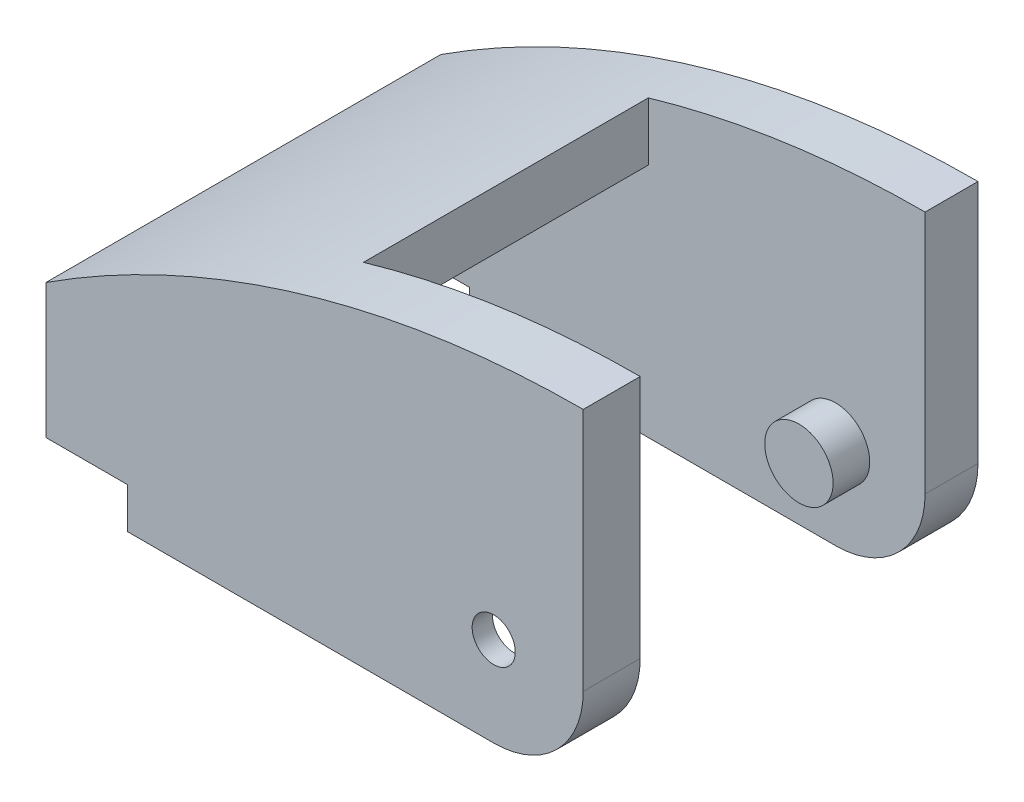
ISO-10303-21;
HEADER;
FILE_DESCRIPTION(('STEP AP214'),'2;1');
FILE_NAME('part.step','',(''),(''),'','','');
FILE_SCHEMA(('AUTOMOTIVE_DESIGN { 1 0 10303 214 1 1 1 1 }'));
ENDSEC;
DATA;
#1=APPLICATION_CONTEXT('core data for automotive mechanical design processes');
#2=APPLICATION_PROTOCOL_DEFINITION('international standard','automotive_design',2000,#1);
#3=PRODUCT_CONTEXT('',#1,'mechanical');
#4=PRODUCT('Part','Part','',(#3));
#5=PRODUCT_RELATED_PRODUCT_CATEGORY('part','',(#4));
#6=PRODUCT_DEFINITION_FORMATION('','',#4);
#7=PRODUCT_DEFINITION_CONTEXT('part definition',#1,'design');
#8=PRODUCT_DEFINITION('design','',#6,#7);
#9=PRODUCT_DEFINITION_SHAPE('','',#8);
#10=(LENGTH_UNIT() NAMED_UNIT(*) SI_UNIT(.MILLI.,.METRE.));
#11=(NAMED_UNIT(*) PLANE_ANGLE_UNIT() SI_UNIT($,.RADIAN.));
#12=(NAMED_UNIT(*) SI_UNIT($,.STERADIAN.) SOLID_ANGLE_UNIT());
#13=UNCERTAINTY_MEASURE_WITH_UNIT(LENGTH_MEASURE(1.E-05),#10,'distance_accuracy_value','');
#14=(GEOMETRIC_REPRESENTATION_CONTEXT(3) GLOBAL_UNCERTAINTY_ASSIGNED_CONTEXT((#13)) GLOBAL_UNIT_ASSIGNED_CONTEXT((#10,
#11,#12)) REPRESENTATION_CONTEXT('',''));
#15=CARTESIAN_POINT('',(0.,0.,0.));
#16=DIRECTION('',(0.,0.,1.));
#17=DIRECTION('',(1.,0.,0.));
#18=AXIS2_PLACEMENT_3D('',#15,#16,#17);
#19=CARTESIAN_POINT('',(12.,-12.,-7.));
#20=DIRECTION('',(0.,0.,1.));
#21=DIRECTION('',(0.,-1.,0.));
#22=AXIS2_PLACEMENT_3D('',#19,#20,#21);
#23=PLANE('',#22);
#24=CARTESIAN_POINT('',(0.,0.,-7.));
#25=DIRECTION('',(0.,0.,-1.));
#26=DIRECTION('',(0.,1.,0.));
#27=AXIS2_PLACEMENT_3D('',#24,#25,#26);
#28=CIRCLE('',#27,9.5);
#29=CARTESIAN_POINT('',(0.,9.5,-7.));
#30=VERTEX_POINT('',#29);
#31=EDGE_CURVE('E342',#30,#30,#28,.T.);
#32=ORIENTED_EDGE('',*,*,#31,.F.);
#33=EDGE_LOOP('',(#32));
#34=FACE_BOUND('',#33,.T.);
#35=DIRECTION('',(-1.,0.,0.));
#36=VECTOR('',#35,1.);
#37=CARTESIAN_POINT('',(0.,-11.,-7.));
#38=LINE('',#37,#36);
#39=CARTESIAN_POINT('',(0.,-11.,-7.));
#40=VERTEX_POINT('',#39);
#41=CARTESIAN_POINT('',(-45.,-11.,-6.99999999999999));
#42=VERTEX_POINT('',#41);
#43=EDGE_CURVE('E283',#40,#42,#38,.T.);
#44=ORIENTED_EDGE('',*,*,#43,.T.);
#45=DIRECTION('',(0.,1.,0.));
#46=VECTOR('',#45,1.);
#47=CARTESIAN_POINT('',(-45.,-12.,-7.));
#48=LINE('',#47,#46);
#49=CARTESIAN_POINT('',(-45.,-6.00000000000001,-7.));
#50=VERTEX_POINT('',#49);
#51=EDGE_CURVE('E209',#42,#50,#48,.T.);
#52=ORIENTED_EDGE('',*,*,#51,.T.);
#53=DIRECTION('',(-1.,0.,0.));
#54=VECTOR('',#53,1.);
#55=CARTESIAN_POINT('',(12.,-6.00000000000001,-7.));
#56=LINE('',#55,#54);
#57=CARTESIAN_POINT('',(-55.,-6.,-6.99999999999999));
#58=VERTEX_POINT('',#57);
#59=EDGE_CURVE('E169',#50,#58,#56,.T.);
#60=ORIENTED_EDGE('',*,*,#59,.T.);
#61=DIRECTION('',(0.,-1.,0.));
#62=VECTOR('',#61,1.);
#63=CARTESIAN_POINT('',(-55.,-12.,-7.));
#64=LINE('',#63,#62);
#65=CARTESIAN_POINT('',(-54.9999999999999,6.91625959501332,-6.99999999999999));
#66=VERTEX_POINT('',#65);
#67=EDGE_CURVE('E224',#66,#58,#64,.T.);
#68=ORIENTED_EDGE('',*,*,#67,.F.);
#69=CARTESIAN_POINT('',(11.,-91.4878048780488,-6.99999999999999));
#70=DIRECTION('',(0.,0.,1.));
#71=DIRECTION('',(0.,-1.,0.));
#72=AXIS2_PLACEMENT_3D('',#69,#70,#71);
#73=CIRCLE('',#72,118.487804878049);
#74=CARTESIAN_POINT('',(-34.2965836217796,18.,-6.99999999999999));
#75=VERTEX_POINT('',#74);
#76=EDGE_CURVE('E260',#75,#66,#73,.T.);
#77=ORIENTED_EDGE('',*,*,#76,.F.);
#78=DIRECTION('',(1.,0.,0.));
#79=VECTOR('',#78,1.);
#80=CARTESIAN_POINT('',(0.,18.,-7.));
#81=LINE('',#80,#79);
#82=CARTESIAN_POINT('',(-23.,18.,-7.));
#83=VERTEX_POINT('',#82);
#84=EDGE_CURVE('E287',#75,#83,#81,.T.);
#85=ORIENTED_EDGE('',*,*,#84,.T.);
#86=DIRECTION('',(0.,1.,0.));
#87=VECTOR('',#86,1.);
#88=CARTESIAN_POINT('',(-23.,15.5,-6.99999999999999));
#89=LINE('',#88,#87);
#90=CARTESIAN_POINT('',(-23.,25.1453239237065,-6.99999999999999));
#91=VERTEX_POINT('',#90);
#92=EDGE_CURVE('E330',#83,#91,#89,.T.);
#93=ORIENTED_EDGE('',*,*,#92,.T.);
#94=CARTESIAN_POINT('',(11.0000000000003,-91.4878048780494,-6.99999999999999));
#95=DIRECTION('',(0.,0.,1.));
#96=DIRECTION('',(0.,-1.,0.));
#97=AXIS2_PLACEMENT_3D('',#94,#95,#96);
#98=CIRCLE('',#97,121.487804878049);
#99=CARTESIAN_POINT('',(11.,30.,-7.00000000000003));
#100=VERTEX_POINT('',#99);
#101=EDGE_CURVE('E268',#91,#100,#98,.F.);
#102=ORIENTED_EDGE('',*,*,#101,.T.);
#103=DIRECTION('',(0.,-1.,0.));
#104=VECTOR('',#103,1.);
#105=CARTESIAN_POINT('',(11.,-12.,-7.));
#106=LINE('',#105,#104);
#107=CARTESIAN_POINT('',(11.,0.,-7.00000000000001));
#108=VERTEX_POINT('',#107);
#109=EDGE_CURVE('E326',#100,#108,#106,.T.);
#110=ORIENTED_EDGE('',*,*,#109,.T.);
#111=CARTESIAN_POINT('',(0.,0.,-7.));
#112=DIRECTION('',(0.,0.,1.));
#113=DIRECTION('',(0.,-1.,0.));
#114=AXIS2_PLACEMENT_3D('',#111,#112,#113);
#115=CIRCLE('',#114,11.);
#116=EDGE_CURVE('E318',#40,#108,#115,.T.);
#117=ORIENTED_EDGE('',*,*,#116,.F.);
#118=EDGE_LOOP('',(#44,#52,#60,#68,#77,#85,#93,#102,#110,#117));
#119=FACE_BOUND('',#118,.T.);
#120=ADVANCED_FACE('F47',(#34,#119),#23,.F.);
#121=CARTESIAN_POINT('',(0.,0.,0.));
#122=DIRECTION('',(0.,0.,1.));
#123=DIRECTION('',(1.,0.,0.));
#124=AXIS2_PLACEMENT_3D('',#121,#122,#123);
#125=PLANE('',#124);
#126=DIRECTION('',(0.,-1.,0.));
#127=VECTOR('',#126,1.);
#128=CARTESIAN_POINT('',(-45.,-11.,0.));
#129=LINE('',#128,#127);
#130=CARTESIAN_POINT('',(-45.,-6.00000000000001,0.));
#131=VERTEX_POINT('',#130);
#132=CARTESIAN_POINT('',(-45.,-11.,0.));
#133=VERTEX_POINT('',#132);
#134=EDGE_CURVE('E177',#131,#133,#129,.T.);
#135=ORIENTED_EDGE('',*,*,#134,.T.);
#136=DIRECTION('',(-1.,0.,0.));
#137=VECTOR('',#136,1.);
#138=CARTESIAN_POINT('',(0.,-11.,0.));
#139=LINE('',#138,#137);
#140=CARTESIAN_POINT('',(0.,-11.,0.));
#141=VERTEX_POINT('',#140);
#142=EDGE_CURVE('E288',#141,#133,#139,.T.);
#143=ORIENTED_EDGE('',*,*,#142,.F.);
#144=CARTESIAN_POINT('',(0.,0.,0.));
#145=DIRECTION('',(0.,0.,1.));
#146=DIRECTION('',(1.,0.,0.));
#147=AXIS2_PLACEMENT_3D('',#144,#145,#146);
#148=CIRCLE('',#147,11.);
#149=CARTESIAN_POINT('',(11.,0.,0.));
#150=VERTEX_POINT('',#149);
#151=EDGE_CURVE('E305',#141,#150,#148,.T.);
#152=ORIENTED_EDGE('',*,*,#151,.T.);
#153=DIRECTION('',(0.,-1.,0.));
#154=VECTOR('',#153,1.);
#155=CARTESIAN_POINT('',(11.,0.,0.));
#156=LINE('',#155,#154);
#157=CARTESIAN_POINT('',(11.,30.,0.));
#158=VERTEX_POINT('',#157);
#159=EDGE_CURVE('E299',#158,#150,#156,.T.);
#160=ORIENTED_EDGE('',*,*,#159,.F.);
#161=CARTESIAN_POINT('',(11.,-91.4878048780488,0.));
#162=DIRECTION('',(0.,0.,1.));
#163=DIRECTION('',(1.,0.,0.));
#164=AXIS2_PLACEMENT_3D('',#161,#162,#163);
#165=CIRCLE('',#164,121.487804878049);
#166=CARTESIAN_POINT('',(-55.,10.5086986604885,0.));
#167=VERTEX_POINT('',#166);
#168=EDGE_CURVE('E282',#167,#158,#165,.F.);
#169=ORIENTED_EDGE('',*,*,#168,.F.);
#170=DIRECTION('',(0.,1.,0.));
#171=VECTOR('',#170,1.);
#172=CARTESIAN_POINT('',(-55.,0.,0.));
#173=LINE('',#172,#171);
#174=CARTESIAN_POINT('',(-55.,-6.,0.));
#175=VERTEX_POINT('',#174);
#176=EDGE_CURVE('E190',#175,#167,#173,.T.);
#177=ORIENTED_EDGE('',*,*,#176,.F.);
#178=DIRECTION('',(1.,0.,0.));
#179=VECTOR('',#178,1.);
#180=CARTESIAN_POINT('',(-55.,-6.,0.));
#181=LINE('',#180,#179);
#182=EDGE_CURVE('E71',#175,#131,#181,.T.);
#183=ORIENTED_EDGE('',*,*,#182,.T.);
#184=EDGE_LOOP('',(#135,#143,#152,#160,#169,#177,#183));
#185=FACE_BOUND('',#184,.T.);
#186=CARTESIAN_POINT('',(0.,0.,0.));
#187=DIRECTION('',(0.,0.,1.));
#188=DIRECTION('',(1.,0.,0.));
#189=AXIS2_PLACEMENT_3D('',#186,#187,#188);
#190=CIRCLE('',#189,2.65);
#191=CARTESIAN_POINT('',(2.65,0.,0.));
#192=VERTEX_POINT('',#191);
#193=EDGE_CURVE('E337',#192,#192,#190,.T.);
#194=ORIENTED_EDGE('',*,*,#193,.F.);
#195=EDGE_LOOP('',(#194));
#196=FACE_BOUND('',#195,.T.);
#197=ADVANCED_FACE('F187',(#185,#196),#125,.T.);
#198=CARTESIAN_POINT('',(0.,0.,-48.5));
#199=DIRECTION('',(0.,0.,-1.));
#200=DIRECTION('',(-1.,0.,0.));
#201=AXIS2_PLACEMENT_3D('',#198,#199,#200);
#202=PLANE('',#201);
#203=DIRECTION('',(0.,-1.,0.));
#204=VECTOR('',#203,1.);
#205=CARTESIAN_POINT('',(-45.,-11.,-48.5));
#206=LINE('',#205,#204);
#207=CARTESIAN_POINT('',(-45.,-6.00000000000001,-48.5));
#208=VERTEX_POINT('',#207);
#209=CARTESIAN_POINT('',(-45.,-11.,-48.5));
#210=VERTEX_POINT('',#209);
#211=EDGE_CURVE('E192',#208,#210,#206,.T.);
#212=ORIENTED_EDGE('',*,*,#211,.F.);
#213=DIRECTION('',(1.,0.,0.));
#214=VECTOR('',#213,1.);
#215=CARTESIAN_POINT('',(-55.,-6.,-48.5));
#216=LINE('',#215,#214);
#217=CARTESIAN_POINT('',(-55.,-6.,-48.5));
#218=VERTEX_POINT('',#217);
#219=EDGE_CURVE('E195',#218,#208,#216,.T.);
#220=ORIENTED_EDGE('',*,*,#219,.F.);
#221=DIRECTION('',(0.,1.,0.));
#222=VECTOR('',#221,1.);
#223=CARTESIAN_POINT('',(-55.,0.,-48.5));
#224=LINE('',#223,#222);
#225=CARTESIAN_POINT('',(-55.,10.5086986604885,-48.5));
#226=VERTEX_POINT('',#225);
#227=EDGE_CURVE('E212',#218,#226,#224,.T.);
#228=ORIENTED_EDGE('',*,*,#227,.T.);
#229=CARTESIAN_POINT('',(11.,-91.4878048780488,-48.5));
#230=DIRECTION('',(0.,0.,1.));
#231=DIRECTION('',(1.,0.,0.));
#232=AXIS2_PLACEMENT_3D('',#229,#230,#231);
#233=CIRCLE('',#232,121.487804878049);
#234=CARTESIAN_POINT('',(11.,30.,-48.5));
#235=VERTEX_POINT('',#234);
#236=EDGE_CURVE('E272',#226,#235,#233,.F.);
#237=ORIENTED_EDGE('',*,*,#236,.T.);
#238=DIRECTION('',(0.,-1.,0.));
#239=VECTOR('',#238,1.);
#240=CARTESIAN_POINT('',(11.,0.,-48.5));
#241=LINE('',#240,#239);
#242=CARTESIAN_POINT('',(11.,0.,-48.5));
#243=VERTEX_POINT('',#242);
#244=EDGE_CURVE('E300',#235,#243,#241,.T.);
#245=ORIENTED_EDGE('',*,*,#244,.T.);
#246=CARTESIAN_POINT('',(0.,0.,-48.5));
#247=DIRECTION('',(0.,0.,1.));
#248=DIRECTION('',(1.,0.,0.));
#249=AXIS2_PLACEMENT_3D('',#246,#247,#248);
#250=CIRCLE('',#249,11.);
#251=CARTESIAN_POINT('',(0.,-11.,-48.5));
#252=VERTEX_POINT('',#251);
#253=EDGE_CURVE('E304',#252,#243,#250,.T.);
#254=ORIENTED_EDGE('',*,*,#253,.F.);
#255=DIRECTION('',(-1.,0.,0.));
#256=VECTOR('',#255,1.);
#257=CARTESIAN_POINT('',(0.,-11.,-48.5));
#258=LINE('',#257,#256);
#259=EDGE_CURVE('E275',#252,#210,#258,.T.);
#260=ORIENTED_EDGE('',*,*,#259,.T.);
#261=EDGE_LOOP('',(#212,#220,#228,#237,#245,#254,#260));
#262=FACE_BOUND('',#261,.T.);
#263=ADVANCED_FACE('F367',(#262),#202,.T.);
#264=CARTESIAN_POINT('',(11.,-91.4878048780488,-7.));
#265=DIRECTION('',(0.,0.,1.));
#266=DIRECTION('',(1.,0.,0.));
#267=AXIS2_PLACEMENT_3D('',#264,#265,#266);
#268=CYLINDRICAL_SURFACE('',#267,121.487804878049);
#269=DIRECTION('',(0.,0.,-1.));
#270=VECTOR('',#269,1.);
#271=CARTESIAN_POINT('',(-55.,10.5086986604885,0.));
#272=LINE('',#271,#270);
#273=EDGE_CURVE('E215',#167,#226,#272,.T.);
#274=ORIENTED_EDGE('',*,*,#273,.F.);
#275=ORIENTED_EDGE('',*,*,#168,.T.);
#276=DIRECTION('',(0.,0.,1.));
#277=VECTOR('',#276,1.);
#278=CARTESIAN_POINT('',(11.,30.,-48.5));
#279=LINE('',#278,#277);
#280=EDGE_CURVE('E319',#100,#158,#279,.T.);
#281=ORIENTED_EDGE('',*,*,#280,.F.);
#282=ORIENTED_EDGE('',*,*,#101,.F.);
#283=DIRECTION('',(0.,0.,1.));
#284=VECTOR('',#283,1.);
#285=CARTESIAN_POINT('',(-23.,25.1453239237065,-48.5));
#286=LINE('',#285,#284);
#287=CARTESIAN_POINT('',(-23.,25.1453239237065,-42.));
#288=VERTEX_POINT('',#287);
#289=EDGE_CURVE('E264',#288,#91,#286,.T.);
#290=ORIENTED_EDGE('',*,*,#289,.F.);
#291=CARTESIAN_POINT('',(11.0000000000003,-91.4878048780494,-42.));
#292=DIRECTION('',(0.,0.,1.));
#293=DIRECTION('',(1.,0.,0.));
#294=AXIS2_PLACEMENT_3D('',#291,#292,#293);
#295=CIRCLE('',#294,121.487804878049);
#296=CARTESIAN_POINT('',(11.,30.,-42.));
#297=VERTEX_POINT('',#296);
#298=EDGE_CURVE('E231',#297,#288,#295,.T.);
#299=ORIENTED_EDGE('',*,*,#298,.F.);
#300=EDGE_CURVE('E314',#235,#297,#279,.T.);
#301=ORIENTED_EDGE('',*,*,#300,.F.);
#302=ORIENTED_EDGE('',*,*,#236,.F.);
#303=EDGE_LOOP('',(#274,#275,#281,#282,#290,#299,#301,#302));
#304=FACE_BOUND('',#303,.T.);
#305=ADVANCED_FACE('F373',(#304),#268,.T.);
#306=CARTESIAN_POINT('',(0.,-11.,-7.));
#307=DIRECTION('',(0.,1.,0.));
#308=DIRECTION('',(-1.,0.,0.));
#309=AXIS2_PLACEMENT_3D('',#306,#307,#308);
#310=PLANE('',#309);
#311=DIRECTION('',(1.,0.,0.));
#312=VECTOR('',#311,1.);
#313=CARTESIAN_POINT('',(0.,-11.,-42.));
#314=LINE('',#313,#312);
#315=CARTESIAN_POINT('',(-45.,-11.,-42.));
#316=VERTEX_POINT('',#315);
#317=CARTESIAN_POINT('',(0.,-11.,-42.));
#318=VERTEX_POINT('',#317);
#319=EDGE_CURVE('E247',#316,#318,#314,.T.);
#320=ORIENTED_EDGE('',*,*,#319,.F.);
#321=DIRECTION('',(0.,0.,-1.));
#322=VECTOR('',#321,1.);
#323=CARTESIAN_POINT('',(-45.,-11.,0.));
#324=LINE('',#323,#322);
#325=EDGE_CURVE('E173',#316,#210,#324,.T.);
#326=ORIENTED_EDGE('',*,*,#325,.T.);
#327=ORIENTED_EDGE('',*,*,#259,.F.);
#328=DIRECTION('',(0.,0.,-1.));
#329=VECTOR('',#328,1.);
#330=CARTESIAN_POINT('',(0.,-11.,-41.5));
#331=LINE('',#330,#329);
#332=EDGE_CURVE('E279',#318,#252,#331,.T.);
#333=ORIENTED_EDGE('',*,*,#332,.F.);
#334=EDGE_LOOP('',(#320,#326,#327,#333));
#335=FACE_BOUND('',#334,.T.);
#336=ADVANCED_FACE('F388',(#335),#310,.F.);
#337=ORIENTED_EDGE('',*,*,#142,.T.);
#338=EDGE_CURVE('E180',#133,#42,#324,.T.);
#339=ORIENTED_EDGE('',*,*,#338,.T.);
#340=ORIENTED_EDGE('',*,*,#43,.F.);
#341=DIRECTION('',(0.,0.,1.));
#342=VECTOR('',#341,1.);
#343=CARTESIAN_POINT('',(0.,-11.,-7.));
#344=LINE('',#343,#342);
#345=EDGE_CURVE('E291',#40,#141,#344,.T.);
#346=ORIENTED_EDGE('',*,*,#345,.T.);
#347=EDGE_LOOP('',(#337,#339,#340,#346));
#348=FACE_BOUND('',#347,.T.);
#349=ADVANCED_FACE('F429',(#348),#310,.F.);
#350=CARTESIAN_POINT('',(11.,-91.4878048780488,-41.5));
#351=DIRECTION('',(0.,0.,1.));
#352=DIRECTION('',(1.,0.,0.));
#353=AXIS2_PLACEMENT_3D('',#350,#351,#352);
#354=CYLINDRICAL_SURFACE('',#353,118.487804878049);
#355=DIRECTION('',(0.,0.,1.));
#356=VECTOR('',#355,1.);
#357=CARTESIAN_POINT('',(-54.9999999999999,6.91625959501332,-41.5));
#358=LINE('',#357,#356);
#359=CARTESIAN_POINT('',(-55.,6.91625959501332,-42.));
#360=VERTEX_POINT('',#359);
#361=EDGE_CURVE('E221',#360,#66,#358,.T.);
#362=ORIENTED_EDGE('',*,*,#361,.F.);
#363=CARTESIAN_POINT('',(11.,-91.4878048780488,-42.));
#364=DIRECTION('',(0.,0.,1.));
#365=DIRECTION('',(1.,0.,0.));
#366=AXIS2_PLACEMENT_3D('',#363,#364,#365);
#367=CIRCLE('',#366,118.487804878049);
#368=CARTESIAN_POINT('',(-34.2965836217796,18.,-42.));
#369=VERTEX_POINT('',#368);
#370=EDGE_CURVE('E243',#369,#360,#367,.T.);
#371=ORIENTED_EDGE('',*,*,#370,.F.);
#372=DIRECTION('',(0.,0.,1.));
#373=VECTOR('',#372,1.);
#374=CARTESIAN_POINT('',(-34.2965836217796,18.,-41.5));
#375=LINE('',#374,#373);
#376=EDGE_CURVE('E257',#369,#75,#375,.T.);
#377=ORIENTED_EDGE('',*,*,#376,.T.);
#378=ORIENTED_EDGE('',*,*,#76,.T.);
#379=EDGE_LOOP('',(#362,#371,#377,#378));
#380=FACE_BOUND('',#379,.T.);
#381=ADVANCED_FACE('F402',(#380),#354,.F.);
#382=CARTESIAN_POINT('',(0.,0.,-42.));
#383=DIRECTION('',(0.,0.,1.));
#384=DIRECTION('',(1.,0.,0.));
#385=AXIS2_PLACEMENT_3D('',#382,#383,#384);
#386=PLANE('',#385);
#387=DIRECTION('',(0.,1.,0.));
#388=VECTOR('',#387,1.);
#389=CARTESIAN_POINT('',(-45.,0.,-42.));
#390=LINE('',#389,#388);
#391=CARTESIAN_POINT('',(-45.,-6.00000000000001,-42.));
#392=VERTEX_POINT('',#391);
#393=EDGE_CURVE('E11',#316,#392,#390,.T.);
#394=ORIENTED_EDGE('',*,*,#393,.F.);
#395=ORIENTED_EDGE('',*,*,#319,.T.);
#396=CARTESIAN_POINT('',(0.,0.,-42.));
#397=DIRECTION('',(0.,0.,1.));
#398=DIRECTION('',(1.,0.,0.));
#399=AXIS2_PLACEMENT_3D('',#396,#397,#398);
#400=CIRCLE('',#399,11.);
#401=CARTESIAN_POINT('',(11.,0.,-42.));
#402=VERTEX_POINT('',#401);
#403=EDGE_CURVE('E250',#318,#402,#400,.T.);
#404=ORIENTED_EDGE('',*,*,#403,.T.);
#405=DIRECTION('',(0.,1.,0.));
#406=VECTOR('',#405,1.);
#407=CARTESIAN_POINT('',(11.,0.,-42.));
#408=LINE('',#407,#406);
#409=EDGE_CURVE('E228',#402,#297,#408,.T.);
#410=ORIENTED_EDGE('',*,*,#409,.T.);
#411=ORIENTED_EDGE('',*,*,#298,.T.);
#412=DIRECTION('',(0.,-1.,0.));
#413=VECTOR('',#412,1.);
#414=CARTESIAN_POINT('',(-23.,0.,-42.));
#415=LINE('',#414,#413);
#416=CARTESIAN_POINT('',(-23.,18.,-42.));
#417=VERTEX_POINT('',#416);
#418=EDGE_CURVE('E235',#288,#417,#415,.T.);
#419=ORIENTED_EDGE('',*,*,#418,.T.);
#420=DIRECTION('',(-1.,0.,0.));
#421=VECTOR('',#420,1.);
#422=CARTESIAN_POINT('',(0.,18.,-42.));
#423=LINE('',#422,#421);
#424=EDGE_CURVE('E239',#417,#369,#423,.T.);
#425=ORIENTED_EDGE('',*,*,#424,.T.);
#426=ORIENTED_EDGE('',*,*,#370,.T.);
#427=DIRECTION('',(0.,-1.,0.));
#428=VECTOR('',#427,1.);
#429=CARTESIAN_POINT('',(-55.,0.,-42.));
#430=LINE('',#429,#428);
#431=CARTESIAN_POINT('',(-55.,-6.,-42.));
#432=VERTEX_POINT('',#431);
#433=EDGE_CURVE('E357',#360,#432,#430,.T.);
#434=ORIENTED_EDGE('',*,*,#433,.T.);
#435=DIRECTION('',(-1.,0.,0.));
#436=VECTOR('',#435,1.);
#437=CARTESIAN_POINT('',(0.,-6.00000000000001,-42.));
#438=LINE('',#437,#436);
#439=EDGE_CURVE('E63',#392,#432,#438,.T.);
#440=ORIENTED_EDGE('',*,*,#439,.F.);
#441=EDGE_LOOP('',(#394,#395,#404,#410,#411,#419,#425,#426,#434,#440));
#442=FACE_BOUND('',#441,.T.);
#443=CARTESIAN_POINT('',(0.,0.,-42.));
#444=DIRECTION('',(0.,0.,1.));
#445=DIRECTION('',(1.,0.,0.));
#446=AXIS2_PLACEMENT_3D('',#443,#444,#445);
#447=CIRCLE('',#446,4.2);
#448=CARTESIAN_POINT('',(4.2,0.,-42.));
#449=VERTEX_POINT('',#448);
#450=EDGE_CURVE('E253',#449,#449,#447,.F.);
#451=ORIENTED_EDGE('',*,*,#450,.T.);
#452=EDGE_LOOP('',(#451));
#453=FACE_BOUND('',#452,.T.);
#454=ADVANCED_FACE('F396',(#442,#453),#386,.T.);
#455=CARTESIAN_POINT('',(0.,0.,-48.5));
#456=DIRECTION('',(0.,0.,1.));
#457=DIRECTION('',(1.,0.,0.));
#458=AXIS2_PLACEMENT_3D('',#455,#456,#457);
#459=CYLINDRICAL_SURFACE('',#458,11.);
#460=DIRECTION('',(0.,0.,1.));
#461=VECTOR('',#460,1.);
#462=CARTESIAN_POINT('',(11.,0.,-48.5));
#463=LINE('',#462,#461);
#464=EDGE_CURVE('E320',#243,#402,#463,.T.);
#465=ORIENTED_EDGE('',*,*,#464,.T.);
#466=ORIENTED_EDGE('',*,*,#403,.F.);
#467=ORIENTED_EDGE('',*,*,#332,.T.);
#468=ORIENTED_EDGE('',*,*,#253,.T.);
#469=EDGE_LOOP('',(#465,#466,#467,#468));
#470=FACE_BOUND('',#469,.T.);
#471=ADVANCED_FACE('F384',(#470),#459,.T.);
#472=CARTESIAN_POINT('',(11.,0.,-48.5));
#473=DIRECTION('',(-1.,0.,0.));
#474=DIRECTION('',(0.,0.,1.));
#475=AXIS2_PLACEMENT_3D('',#472,#473,#474);
#476=PLANE('',#475);
#477=ORIENTED_EDGE('',*,*,#409,.F.);
#478=ORIENTED_EDGE('',*,*,#464,.F.);
#479=ORIENTED_EDGE('',*,*,#244,.F.);
#480=ORIENTED_EDGE('',*,*,#300,.T.);
#481=EDGE_LOOP('',(#477,#478,#479,#480));
#482=FACE_BOUND('',#481,.T.);
#483=ADVANCED_FACE('F381',(#482),#476,.F.);
#484=CARTESIAN_POINT('',(12.,18.,-7.));
#485=DIRECTION('',(0.,1.,0.));
#486=DIRECTION('',(0.,0.,1.));
#487=AXIS2_PLACEMENT_3D('',#484,#485,#486);
#488=PLANE('',#487);
#489=ORIENTED_EDGE('',*,*,#376,.F.);
#490=ORIENTED_EDGE('',*,*,#424,.F.);
#491=DIRECTION('',(0.,0.,1.));
#492=VECTOR('',#491,1.);
#493=CARTESIAN_POINT('',(-23.,18.,-6.99999999999999));
#494=LINE('',#493,#492);
#495=EDGE_CURVE('E350',#417,#83,#494,.T.);
#496=ORIENTED_EDGE('',*,*,#495,.T.);
#497=ORIENTED_EDGE('',*,*,#84,.F.);
#498=EDGE_LOOP('',(#489,#490,#496,#497));
#499=FACE_BOUND('',#498,.T.);
#500=ADVANCED_FACE('F408',(#499),#488,.F.);
#501=ORIENTED_EDGE('',*,*,#151,.F.);
#502=ORIENTED_EDGE('',*,*,#345,.F.);
#503=ORIENTED_EDGE('',*,*,#116,.T.);
#504=EDGE_CURVE('E308',#108,#150,#463,.T.);
#505=ORIENTED_EDGE('',*,*,#504,.T.);
#506=EDGE_LOOP('',(#501,#502,#503,#505));
#507=FACE_BOUND('',#506,.T.);
#508=ADVANCED_FACE('F424',(#507),#459,.T.);
#509=CARTESIAN_POINT('',(0.,0.,-48.));
#510=DIRECTION('',(0.,0.,1.));
#511=DIRECTION('',(1.,0.,0.));
#512=AXIS2_PLACEMENT_3D('',#509,#510,#511);
#513=CYLINDRICAL_SURFACE('',#512,2.65);
#514=ORIENTED_EDGE('',*,*,#193,.T.);
#515=EDGE_LOOP('',(#514));
#516=FACE_BOUND('',#515,.T.);
#517=CARTESIAN_POINT('',(0.,0.,-2.5));
#518=DIRECTION('',(0.,0.,-1.));
#519=DIRECTION('',(0.,1.,0.));
#520=AXIS2_PLACEMENT_3D('',#517,#518,#519);
#521=CIRCLE('',#520,2.65);
#522=CARTESIAN_POINT('',(0.,2.65,-2.5));
#523=VERTEX_POINT('',#522);
#524=EDGE_CURVE('E338',#523,#523,#521,.F.);
#525=ORIENTED_EDGE('',*,*,#524,.F.);
#526=EDGE_LOOP('',(#525));
#527=FACE_BOUND('',#526,.T.);
#528=ADVANCED_FACE('F49',(#516,#527),#513,.F.);
#529=CARTESIAN_POINT('',(0.,0.,-2.5));
#530=DIRECTION('',(0.,0.,-1.));
#531=DIRECTION('',(0.,1.,0.));
#532=AXIS2_PLACEMENT_3D('',#529,#530,#531);
#533=PLANE('',#532);
#534=CARTESIAN_POINT('',(0.,0.,-2.5));
#535=DIRECTION('',(0.,0.,-1.));
#536=DIRECTION('',(0.,1.,0.));
#537=AXIS2_PLACEMENT_3D('',#534,#535,#536);
#538=CIRCLE('',#537,9.5);
#539=CARTESIAN_POINT('',(0.,9.5,-2.5));
#540=VERTEX_POINT('',#539);
#541=EDGE_CURVE('E343',#540,#540,#538,.T.);
#542=ORIENTED_EDGE('',*,*,#541,.T.);
#543=EDGE_LOOP('',(#542));
#544=FACE_BOUND('',#543,.T.);
#545=ORIENTED_EDGE('',*,*,#524,.T.);
#546=EDGE_LOOP('',(#545));
#547=FACE_BOUND('',#546,.T.);
#548=ADVANCED_FACE('F453',(#544,#547),#533,.T.);
#549=CARTESIAN_POINT('',(0.,0.,-2.5));
#550=DIRECTION('',(0.,0.,-1.));
#551=DIRECTION('',(0.,1.,0.));
#552=AXIS2_PLACEMENT_3D('',#549,#550,#551);
#553=CYLINDRICAL_SURFACE('',#552,9.5);
#554=ORIENTED_EDGE('',*,*,#541,.F.);
#555=EDGE_LOOP('',(#554));
#556=FACE_BOUND('',#555,.T.);
#557=ORIENTED_EDGE('',*,*,#31,.T.);
#558=EDGE_LOOP('',(#557));
#559=FACE_BOUND('',#558,.T.);
#560=ADVANCED_FACE('F451',(#556,#559),#553,.F.);
#561=CARTESIAN_POINT('',(-23.,15.5,-41.));
#562=DIRECTION('',(-1.,0.,0.));
#563=DIRECTION('',(0.,0.,1.));
#564=AXIS2_PLACEMENT_3D('',#561,#562,#563);
#565=PLANE('',#564);
#566=ORIENTED_EDGE('',*,*,#289,.T.);
#567=ORIENTED_EDGE('',*,*,#92,.F.);
#568=ORIENTED_EDGE('',*,*,#495,.F.);
#569=ORIENTED_EDGE('',*,*,#418,.F.);
#570=EDGE_LOOP('',(#566,#567,#568,#569));
#571=FACE_BOUND('',#570,.T.);
#572=ADVANCED_FACE('F412',(#571),#565,.F.);
#573=ORIENTED_EDGE('',*,*,#280,.T.);
#574=ORIENTED_EDGE('',*,*,#159,.T.);
#575=ORIENTED_EDGE('',*,*,#504,.F.);
#576=ORIENTED_EDGE('',*,*,#109,.F.);
#577=EDGE_LOOP('',(#573,#574,#575,#576));
#578=FACE_BOUND('',#577,.T.);
#579=ADVANCED_FACE('F427',(#578),#476,.F.);
#580=CARTESIAN_POINT('',(0.,0.,-37.5));
#581=DIRECTION('',(0.,0.,1.));
#582=DIRECTION('',(1.,0.,0.));
#583=AXIS2_PLACEMENT_3D('',#580,#581,#582);
#584=PLANE('',#583);
#585=CARTESIAN_POINT('',(0.,0.,-37.5));
#586=DIRECTION('',(0.,0.,1.));
#587=DIRECTION('',(1.,0.,0.));
#588=AXIS2_PLACEMENT_3D('',#585,#586,#587);
#589=CIRCLE('',#588,4.2);
#590=CARTESIAN_POINT('',(4.2,0.,-37.5));
#591=VERTEX_POINT('',#590);
#592=EDGE_CURVE('E333',#591,#591,#589,.T.);
#593=ORIENTED_EDGE('',*,*,#592,.T.);
#594=EDGE_LOOP('',(#593));
#595=FACE_BOUND('',#594,.T.);
#596=ADVANCED_FACE('F611',(#595),#584,.T.);
#597=CARTESIAN_POINT('',(0.,0.,-37.5));
#598=DIRECTION('',(0.,0.,-1.));
#599=DIRECTION('',(-1.,0.,0.));
#600=AXIS2_PLACEMENT_3D('',#597,#598,#599);
#601=CYLINDRICAL_SURFACE('',#600,4.2);
#602=ORIENTED_EDGE('',*,*,#592,.F.);
#603=EDGE_LOOP('',(#602));
#604=FACE_BOUND('',#603,.T.);
#605=ORIENTED_EDGE('',*,*,#450,.F.);
#606=EDGE_LOOP('',(#605));
#607=FACE_BOUND('',#606,.T.);
#608=ADVANCED_FACE('F486',(#604,#607),#601,.T.);
#609=CARTESIAN_POINT('',(-55.,0.,0.));
#610=DIRECTION('',(-1.,0.,0.));
#611=DIRECTION('',(0.,-1.,0.));
#612=AXIS2_PLACEMENT_3D('',#609,#610,#611);
#613=PLANE('',#612);
#614=DIRECTION('',(0.,0.,-1.));
#615=VECTOR('',#614,1.);
#616=CARTESIAN_POINT('',(-55.,-6.,0.));
#617=LINE('',#616,#615);
#618=EDGE_CURVE('E184',#175,#58,#617,.T.);
#619=ORIENTED_EDGE('',*,*,#618,.F.);
#620=ORIENTED_EDGE('',*,*,#176,.T.);
#621=ORIENTED_EDGE('',*,*,#273,.T.);
#622=ORIENTED_EDGE('',*,*,#227,.F.);
#623=DIRECTION('',(0.,0.,-1.));
#624=VECTOR('',#623,1.);
#625=CARTESIAN_POINT('',(-55.,-6.,0.));
#626=LINE('',#625,#624);
#627=EDGE_CURVE('E56',#432,#218,#626,.T.);
#628=ORIENTED_EDGE('',*,*,#627,.F.);
#629=ORIENTED_EDGE('',*,*,#433,.F.);
#630=ORIENTED_EDGE('',*,*,#361,.T.);
#631=ORIENTED_EDGE('',*,*,#67,.T.);
#632=EDGE_LOOP('',(#619,#620,#621,#622,#628,#629,#630,#631));
#633=FACE_BOUND('',#632,.T.);
#634=ADVANCED_FACE('F368',(#633),#613,.T.);
#635=CARTESIAN_POINT('',(-55.,-6.,0.));
#636=DIRECTION('',(0.,1.,0.));
#637=DIRECTION('',(-1.,0.,0.));
#638=AXIS2_PLACEMENT_3D('',#635,#636,#637);
#639=PLANE('',#638);
#640=ORIENTED_EDGE('',*,*,#439,.T.);
#641=ORIENTED_EDGE('',*,*,#627,.T.);
#642=ORIENTED_EDGE('',*,*,#219,.T.);
#643=DIRECTION('',(0.,0.,-1.));
#644=VECTOR('',#643,1.);
#645=CARTESIAN_POINT('',(-45.,-6.00000000000001,0.));
#646=LINE('',#645,#644);
#647=EDGE_CURVE('E174',#392,#208,#646,.T.);
#648=ORIENTED_EDGE('',*,*,#647,.F.);
#649=EDGE_LOOP('',(#640,#641,#642,#648));
#650=FACE_BOUND('',#649,.T.);
#651=ADVANCED_FACE('F362',(#650),#639,.F.);
#652=CARTESIAN_POINT('',(-45.,-11.,0.));
#653=DIRECTION('',(1.,0.,0.));
#654=DIRECTION('',(0.,0.,-1.));
#655=AXIS2_PLACEMENT_3D('',#652,#653,#654);
#656=PLANE('',#655);
#657=ORIENTED_EDGE('',*,*,#393,.T.);
#658=ORIENTED_EDGE('',*,*,#647,.T.);
#659=ORIENTED_EDGE('',*,*,#211,.T.);
#660=ORIENTED_EDGE('',*,*,#325,.F.);
#661=EDGE_LOOP('',(#657,#658,#659,#660));
#662=FACE_BOUND('',#661,.T.);
#663=ADVANCED_FACE('F394',(#662),#656,.F.);
#664=ORIENTED_EDGE('',*,*,#338,.F.);
#665=ORIENTED_EDGE('',*,*,#134,.F.);
#666=EDGE_CURVE('E165',#131,#50,#646,.T.);
#667=ORIENTED_EDGE('',*,*,#666,.T.);
#668=ORIENTED_EDGE('',*,*,#51,.F.);
#669=EDGE_LOOP('',(#664,#665,#667,#668));
#670=FACE_BOUND('',#669,.T.);
#671=ADVANCED_FACE('F178',(#670),#656,.F.);
#672=ORIENTED_EDGE('',*,*,#666,.F.);
#673=ORIENTED_EDGE('',*,*,#182,.F.);
#674=ORIENTED_EDGE('',*,*,#618,.T.);
#675=ORIENTED_EDGE('',*,*,#59,.F.);
#676=EDGE_LOOP('',(#672,#673,#674,#675));
#677=FACE_BOUND('',#676,.T.);
#678=ADVANCED_FACE('F167',(#677),#639,.F.);
#679=CLOSED_SHELL('',(#120,#197,#263,#305,#336,#349,#381,#454,#471,#483,#500,#508,#528,#548,
#560,#572,#579,#596,#608,#634,#651,#663,#671,#678));
#680=MANIFOLD_SOLID_BREP('B2',#679);
#681=ADVANCED_BREP_SHAPE_REPRESENTATION('',(#18,#680),#14);
#682=SHAPE_DEFINITION_REPRESENTATION(#9,#681);
ENDSEC;
END-ISO-10303-21;
